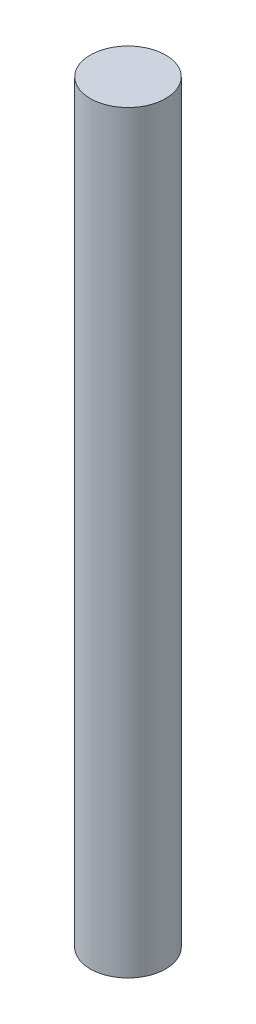
ISO-10303-21;
HEADER;
FILE_DESCRIPTION(('STEP AP214'),'2;1');
FILE_NAME('part.step','',(''),(''),'','','');
FILE_SCHEMA(('AUTOMOTIVE_DESIGN { 1 0 10303 214 1 1 1 1 }'));
ENDSEC;
DATA;
#1=APPLICATION_CONTEXT('core data for automotive mechanical design processes');
#2=APPLICATION_PROTOCOL_DEFINITION('international standard','automotive_design',2000,#1);
#3=PRODUCT_CONTEXT('',#1,'mechanical');
#4=PRODUCT('Part','Part','',(#3));
#5=PRODUCT_RELATED_PRODUCT_CATEGORY('part','',(#4));
#6=PRODUCT_DEFINITION_FORMATION('','',#4);
#7=PRODUCT_DEFINITION_CONTEXT('part definition',#1,'design');
#8=PRODUCT_DEFINITION('design','',#6,#7);
#9=PRODUCT_DEFINITION_SHAPE('','',#8);
#10=(LENGTH_UNIT() NAMED_UNIT(*) SI_UNIT(.MILLI.,.METRE.));
#11=(NAMED_UNIT(*) PLANE_ANGLE_UNIT() SI_UNIT($,.RADIAN.));
#12=(NAMED_UNIT(*) SI_UNIT($,.STERADIAN.) SOLID_ANGLE_UNIT());
#13=UNCERTAINTY_MEASURE_WITH_UNIT(LENGTH_MEASURE(1.E-05),#10,'distance_accuracy_value','');
#14=(GEOMETRIC_REPRESENTATION_CONTEXT(3) GLOBAL_UNCERTAINTY_ASSIGNED_CONTEXT((#13)) GLOBAL_UNIT_ASSIGNED_CONTEXT((#10,
#11,#12)) REPRESENTATION_CONTEXT('',''));
#15=CARTESIAN_POINT('',(0.,0.,0.));
#16=DIRECTION('',(0.,0.,1.));
#17=DIRECTION('',(1.,0.,0.));
#18=AXIS2_PLACEMENT_3D('',#15,#16,#17);
#19=CARTESIAN_POINT('',(0.,0.,0.));
#20=DIRECTION('',(0.,1.,0.));
#21=DIRECTION('',(0.,0.,1.));
#22=AXIS2_PLACEMENT_3D('',#19,#20,#21);
#23=CYLINDRICAL_SURFACE('',#22,26.25);
#24=CARTESIAN_POINT('',(0.,0.,0.));
#25=DIRECTION('',(0.,1.,0.));
#26=DIRECTION('',(0.,0.,1.));
#27=AXIS2_PLACEMENT_3D('',#24,#25,#26);
#28=CIRCLE('',#27,26.25);
#29=CARTESIAN_POINT('',(0.,0.,26.25));
#30=VERTEX_POINT('',#29);
#31=EDGE_CURVE('E10',#30,#30,#28,.T.);
#32=ORIENTED_EDGE('',*,*,#31,.T.);
#33=EDGE_LOOP('',(#32));
#34=FACE_BOUND('',#33,.T.);
#35=CARTESIAN_POINT('',(0.,525.,0.));
#36=DIRECTION('',(0.,1.,0.));
#37=DIRECTION('',(0.,0.,1.));
#38=AXIS2_PLACEMENT_3D('',#35,#36,#37);
#39=CIRCLE('',#38,26.25);
#40=CARTESIAN_POINT('',(0.,525.,26.25));
#41=VERTEX_POINT('',#40);
#42=EDGE_CURVE('E38',#41,#41,#39,.T.);
#43=ORIENTED_EDGE('',*,*,#42,.F.);
#44=EDGE_LOOP('',(#43));
#45=FACE_BOUND('',#44,.T.);
#46=ADVANCED_FACE('F32',(#34,#45),#23,.T.);
#47=CARTESIAN_POINT('',(26.25,0.,0.));
#48=DIRECTION('',(0.,-1.,0.));
#49=DIRECTION('',(0.,0.,-1.));
#50=AXIS2_PLACEMENT_3D('',#47,#48,#49);
#51=PLANE('',#50);
#52=ORIENTED_EDGE('',*,*,#31,.F.);
#53=EDGE_LOOP('',(#52));
#54=FACE_BOUND('',#53,.T.);
#55=ADVANCED_FACE('F47',(#54),#51,.T.);
#56=CARTESIAN_POINT('',(0.,525.,0.));
#57=DIRECTION('',(0.,1.,0.));
#58=DIRECTION('',(0.,0.,1.));
#59=AXIS2_PLACEMENT_3D('',#56,#57,#58);
#60=PLANE('',#59);
#61=ORIENTED_EDGE('',*,*,#42,.T.);
#62=EDGE_LOOP('',(#61));
#63=FACE_BOUND('',#62,.T.);
#64=ADVANCED_FACE('F44',(#63),#60,.T.);
#65=CLOSED_SHELL('',(#46,#55,#64));
#66=MANIFOLD_SOLID_BREP('B2',#65);
#67=ADVANCED_BREP_SHAPE_REPRESENTATION('',(#18,#66),#14);
#68=SHAPE_DEFINITION_REPRESENTATION(#9,#67);
ENDSEC;
END-ISO-10303-21;
